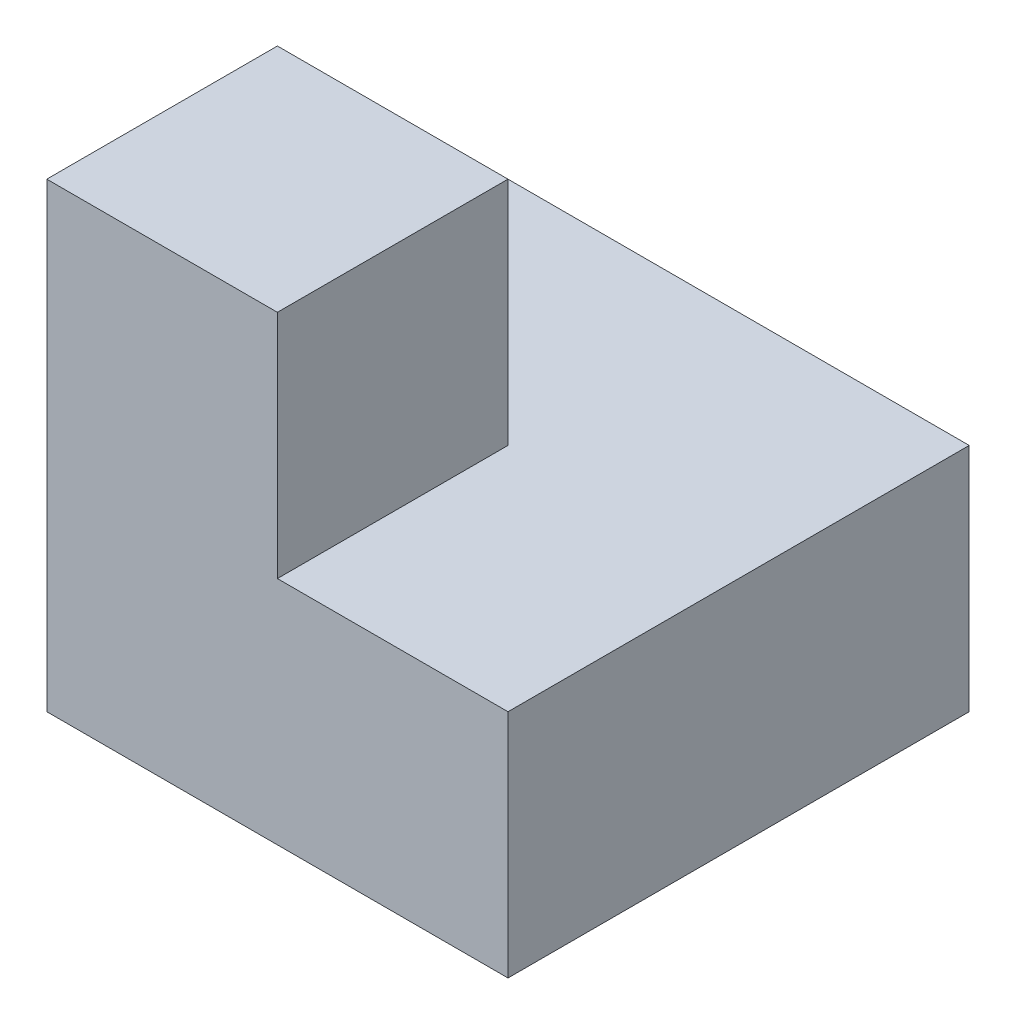
ISO-10303-21;
HEADER;
FILE_DESCRIPTION(('STEP AP214'),'2;1');
FILE_NAME('part.step','',(''),(''),'','','');
FILE_SCHEMA(('AUTOMOTIVE_DESIGN { 1 0 10303 214 1 1 1 1 }'));
ENDSEC;
DATA;
#1=APPLICATION_CONTEXT('core data for automotive mechanical design processes');
#2=APPLICATION_PROTOCOL_DEFINITION('international standard','automotive_design',2000,#1);
#3=PRODUCT_CONTEXT('',#1,'mechanical');
#4=PRODUCT('Part','Part','',(#3));
#5=PRODUCT_RELATED_PRODUCT_CATEGORY('part','',(#4));
#6=PRODUCT_DEFINITION_FORMATION('','',#4);
#7=PRODUCT_DEFINITION_CONTEXT('part definition',#1,'design');
#8=PRODUCT_DEFINITION('design','',#6,#7);
#9=PRODUCT_DEFINITION_SHAPE('','',#8);
#10=(LENGTH_UNIT() NAMED_UNIT(*) SI_UNIT(.MILLI.,.METRE.));
#11=(NAMED_UNIT(*) PLANE_ANGLE_UNIT() SI_UNIT($,.RADIAN.));
#12=(NAMED_UNIT(*) SI_UNIT($,.STERADIAN.) SOLID_ANGLE_UNIT());
#13=UNCERTAINTY_MEASURE_WITH_UNIT(LENGTH_MEASURE(1.E-05),#10,'distance_accuracy_value','');
#14=(GEOMETRIC_REPRESENTATION_CONTEXT(3) GLOBAL_UNCERTAINTY_ASSIGNED_CONTEXT((#13)) GLOBAL_UNIT_ASSIGNED_CONTEXT((#10,
#11,#12)) REPRESENTATION_CONTEXT('',''));
#15=CARTESIAN_POINT('',(0.,0.,0.));
#16=DIRECTION('',(0.,0.,1.));
#17=DIRECTION('',(1.,0.,0.));
#18=AXIS2_PLACEMENT_3D('',#15,#16,#17);
#19=CARTESIAN_POINT('',(4.,4.,0.));
#20=DIRECTION('',(-1.,0.,0.));
#21=DIRECTION('',(0.,0.,1.));
#22=AXIS2_PLACEMENT_3D('',#19,#20,#21);
#23=PLANE('',#22);
#24=DIRECTION('',(0.,0.,-1.));
#25=VECTOR('',#24,1.);
#26=CARTESIAN_POINT('',(4.,2.,0.));
#27=LINE('',#26,#25);
#28=CARTESIAN_POINT('',(4.,2.,0.));
#29=VERTEX_POINT('',#28);
#30=CARTESIAN_POINT('',(4.,2.,-4.));
#31=VERTEX_POINT('',#30);
#32=EDGE_CURVE('E170',#29,#31,#27,.T.);
#33=ORIENTED_EDGE('',*,*,#32,.F.);
#34=DIRECTION('',(0.,-1.,0.));
#35=VECTOR('',#34,1.);
#36=CARTESIAN_POINT('',(4.,4.,0.));
#37=LINE('',#36,#35);
#38=CARTESIAN_POINT('',(4.,0.,0.));
#39=VERTEX_POINT('',#38);
#40=EDGE_CURVE('E43',#29,#39,#37,.T.);
#41=ORIENTED_EDGE('',*,*,#40,.T.);
#42=DIRECTION('',(0.,0.,-1.));
#43=VECTOR('',#42,1.);
#44=CARTESIAN_POINT('',(4.,0.,0.));
#45=LINE('',#44,#43);
#46=CARTESIAN_POINT('',(4.,0.,-4.));
#47=VERTEX_POINT('',#46);
#48=EDGE_CURVE('E93',#39,#47,#45,.T.);
#49=ORIENTED_EDGE('',*,*,#48,.T.);
#50=DIRECTION('',(0.,-1.,0.));
#51=VECTOR('',#50,1.);
#52=CARTESIAN_POINT('',(4.,4.,-4.));
#53=LINE('',#52,#51);
#54=EDGE_CURVE('E78',#31,#47,#53,.T.);
#55=ORIENTED_EDGE('',*,*,#54,.F.);
#56=EDGE_LOOP('',(#33,#41,#49,#55));
#57=FACE_BOUND('',#56,.T.);
#58=ADVANCED_FACE('F35',(#57),#23,.F.);
#59=CARTESIAN_POINT('',(0.,4.,-4.));
#60=DIRECTION('',(0.,0.,1.));
#61=DIRECTION('',(1.,0.,0.));
#62=AXIS2_PLACEMENT_3D('',#59,#60,#61);
#63=PLANE('',#62);
#64=DIRECTION('',(-1.,0.,0.));
#65=VECTOR('',#64,1.);
#66=CARTESIAN_POINT('',(0.,2.,-4.));
#67=LINE('',#66,#65);
#68=CARTESIAN_POINT('',(0.,2.,-4.));
#69=VERTEX_POINT('',#68);
#70=EDGE_CURVE('E87',#31,#69,#67,.T.);
#71=ORIENTED_EDGE('',*,*,#70,.F.);
#72=ORIENTED_EDGE('',*,*,#54,.T.);
#73=DIRECTION('',(-1.,0.,0.));
#74=VECTOR('',#73,1.);
#75=CARTESIAN_POINT('',(0.,0.,-4.));
#76=LINE('',#75,#74);
#77=CARTESIAN_POINT('',(0.,0.,-4.));
#78=VERTEX_POINT('',#77);
#79=EDGE_CURVE('E83',#47,#78,#76,.T.);
#80=ORIENTED_EDGE('',*,*,#79,.T.);
#81=DIRECTION('',(0.,-1.,0.));
#82=VECTOR('',#81,1.);
#83=CARTESIAN_POINT('',(0.,4.,-4.));
#84=LINE('',#83,#82);
#85=EDGE_CURVE('E90',#69,#78,#84,.T.);
#86=ORIENTED_EDGE('',*,*,#85,.F.);
#87=EDGE_LOOP('',(#71,#72,#80,#86));
#88=FACE_BOUND('',#87,.T.);
#89=ADVANCED_FACE('F80',(#88),#63,.F.);
#90=CARTESIAN_POINT('',(0.,4.,0.));
#91=DIRECTION('',(1.,0.,0.));
#92=DIRECTION('',(0.,0.,-1.));
#93=AXIS2_PLACEMENT_3D('',#90,#91,#92);
#94=PLANE('',#93);
#95=DIRECTION('',(0.,0.,1.));
#96=VECTOR('',#95,1.);
#97=CARTESIAN_POINT('',(0.,4.,0.));
#98=LINE('',#97,#96);
#99=CARTESIAN_POINT('',(0.,4.,-2.));
#100=VERTEX_POINT('',#99);
#101=CARTESIAN_POINT('',(0.,4.,0.));
#102=VERTEX_POINT('',#101);
#103=EDGE_CURVE('E58',#100,#102,#98,.T.);
#104=ORIENTED_EDGE('',*,*,#103,.F.);
#105=DIRECTION('',(0.,1.,0.));
#106=VECTOR('',#105,1.);
#107=CARTESIAN_POINT('',(0.,2.,-2.));
#108=LINE('',#107,#106);
#109=CARTESIAN_POINT('',(0.,2.,-2.));
#110=VERTEX_POINT('',#109);
#111=EDGE_CURVE('E114',#110,#100,#108,.T.);
#112=ORIENTED_EDGE('',*,*,#111,.F.);
#113=DIRECTION('',(0.,0.,1.));
#114=VECTOR('',#113,1.);
#115=CARTESIAN_POINT('',(0.,2.,0.));
#116=LINE('',#115,#114);
#117=EDGE_CURVE('E160',#69,#110,#116,.T.);
#118=ORIENTED_EDGE('',*,*,#117,.F.);
#119=ORIENTED_EDGE('',*,*,#85,.T.);
#120=DIRECTION('',(0.,0.,1.));
#121=VECTOR('',#120,1.);
#122=CARTESIAN_POINT('',(0.,0.,0.));
#123=LINE('',#122,#121);
#124=CARTESIAN_POINT('',(0.,0.,0.));
#125=VERTEX_POINT('',#124);
#126=EDGE_CURVE('E101',#78,#125,#123,.T.);
#127=ORIENTED_EDGE('',*,*,#126,.T.);
#128=DIRECTION('',(0.,-1.,0.));
#129=VECTOR('',#128,1.);
#130=CARTESIAN_POINT('',(0.,4.,0.));
#131=LINE('',#130,#129);
#132=EDGE_CURVE('E11',#102,#125,#131,.T.);
#133=ORIENTED_EDGE('',*,*,#132,.F.);
#134=EDGE_LOOP('',(#104,#112,#118,#119,#127,#133));
#135=FACE_BOUND('',#134,.T.);
#136=ADVANCED_FACE('F37',(#135),#94,.F.);
#137=CARTESIAN_POINT('',(0.,4.,0.));
#138=DIRECTION('',(0.,0.,-1.));
#139=DIRECTION('',(-1.,0.,0.));
#140=AXIS2_PLACEMENT_3D('',#137,#138,#139);
#141=PLANE('',#140);
#142=DIRECTION('',(1.,0.,0.));
#143=VECTOR('',#142,1.);
#144=CARTESIAN_POINT('',(0.,2.,0.));
#145=LINE('',#144,#143);
#146=CARTESIAN_POINT('',(2.,2.,0.));
#147=VERTEX_POINT('',#146);
#148=EDGE_CURVE('E164',#147,#29,#145,.T.);
#149=ORIENTED_EDGE('',*,*,#148,.F.);
#150=DIRECTION('',(0.,1.,0.));
#151=VECTOR('',#150,1.);
#152=CARTESIAN_POINT('',(2.,2.,0.));
#153=LINE('',#152,#151);
#154=CARTESIAN_POINT('',(2.,4.,0.));
#155=VERTEX_POINT('',#154);
#156=EDGE_CURVE('E178',#147,#155,#153,.T.);
#157=ORIENTED_EDGE('',*,*,#156,.T.);
#158=DIRECTION('',(1.,0.,0.));
#159=VECTOR('',#158,1.);
#160=CARTESIAN_POINT('',(0.,4.,0.));
#161=LINE('',#160,#159);
#162=EDGE_CURVE('E103',#102,#155,#161,.T.);
#163=ORIENTED_EDGE('',*,*,#162,.F.);
#164=ORIENTED_EDGE('',*,*,#132,.T.);
#165=DIRECTION('',(1.,0.,0.));
#166=VECTOR('',#165,1.);
#167=CARTESIAN_POINT('',(0.,0.,0.));
#168=LINE('',#167,#166);
#169=EDGE_CURVE('E97',#125,#39,#168,.T.);
#170=ORIENTED_EDGE('',*,*,#169,.T.);
#171=ORIENTED_EDGE('',*,*,#40,.F.);
#172=EDGE_LOOP('',(#149,#157,#163,#164,#170,#171));
#173=FACE_BOUND('',#172,.T.);
#174=ADVANCED_FACE('F117',(#173),#141,.F.);
#175=CARTESIAN_POINT('',(0.,4.,0.));
#176=DIRECTION('',(0.,-1.,0.));
#177=DIRECTION('',(0.,0.,-1.));
#178=AXIS2_PLACEMENT_3D('',#175,#176,#177);
#179=PLANE('',#178);
#180=DIRECTION('',(0.,0.,1.));
#181=VECTOR('',#180,1.);
#182=CARTESIAN_POINT('',(2.,4.,0.));
#183=LINE('',#182,#181);
#184=CARTESIAN_POINT('',(2.,4.,-2.));
#185=VERTEX_POINT('',#184);
#186=EDGE_CURVE('E162',#185,#155,#183,.T.);
#187=ORIENTED_EDGE('',*,*,#186,.F.);
#188=DIRECTION('',(1.,0.,0.));
#189=VECTOR('',#188,1.);
#190=CARTESIAN_POINT('',(0.,4.,-2.));
#191=LINE('',#190,#189);
#192=EDGE_CURVE('E50',#100,#185,#191,.T.);
#193=ORIENTED_EDGE('',*,*,#192,.F.);
#194=ORIENTED_EDGE('',*,*,#103,.T.);
#195=ORIENTED_EDGE('',*,*,#162,.T.);
#196=EDGE_LOOP('',(#187,#193,#194,#195));
#197=FACE_BOUND('',#196,.T.);
#198=ADVANCED_FACE('F127',(#197),#179,.F.);
#199=CARTESIAN_POINT('',(0.,0.,0.));
#200=DIRECTION('',(0.,-1.,0.));
#201=DIRECTION('',(0.,0.,-1.));
#202=AXIS2_PLACEMENT_3D('',#199,#200,#201);
#203=PLANE('',#202);
#204=ORIENTED_EDGE('',*,*,#126,.F.);
#205=ORIENTED_EDGE('',*,*,#79,.F.);
#206=ORIENTED_EDGE('',*,*,#48,.F.);
#207=ORIENTED_EDGE('',*,*,#169,.F.);
#208=EDGE_LOOP('',(#204,#205,#206,#207));
#209=FACE_BOUND('',#208,.T.);
#210=ADVANCED_FACE('F99',(#209),#203,.T.);
#211=CARTESIAN_POINT('',(0.,2.,-2.));
#212=DIRECTION('',(0.,0.,1.));
#213=DIRECTION('',(1.,0.,0.));
#214=AXIS2_PLACEMENT_3D('',#211,#212,#213);
#215=PLANE('',#214);
#216=ORIENTED_EDGE('',*,*,#192,.T.);
#217=DIRECTION('',(0.,1.,0.));
#218=VECTOR('',#217,1.);
#219=CARTESIAN_POINT('',(2.,2.,-2.));
#220=LINE('',#219,#218);
#221=CARTESIAN_POINT('',(2.,2.,-2.));
#222=VERTEX_POINT('',#221);
#223=EDGE_CURVE('E175',#222,#185,#220,.T.);
#224=ORIENTED_EDGE('',*,*,#223,.F.);
#225=DIRECTION('',(1.,0.,0.));
#226=VECTOR('',#225,1.);
#227=CARTESIAN_POINT('',(0.,2.,-2.));
#228=LINE('',#227,#226);
#229=EDGE_CURVE('E155',#110,#222,#228,.T.);
#230=ORIENTED_EDGE('',*,*,#229,.F.);
#231=ORIENTED_EDGE('',*,*,#111,.T.);
#232=EDGE_LOOP('',(#216,#224,#230,#231));
#233=FACE_BOUND('',#232,.T.);
#234=ADVANCED_FACE('F136',(#233),#215,.F.);
#235=CARTESIAN_POINT('',(2.,2.,0.));
#236=DIRECTION('',(-1.,0.,0.));
#237=DIRECTION('',(0.,0.,1.));
#238=AXIS2_PLACEMENT_3D('',#235,#236,#237);
#239=PLANE('',#238);
#240=ORIENTED_EDGE('',*,*,#186,.T.);
#241=ORIENTED_EDGE('',*,*,#156,.F.);
#242=DIRECTION('',(0.,0.,1.));
#243=VECTOR('',#242,1.);
#244=CARTESIAN_POINT('',(2.,2.,0.));
#245=LINE('',#244,#243);
#246=EDGE_CURVE('E159',#222,#147,#245,.T.);
#247=ORIENTED_EDGE('',*,*,#246,.F.);
#248=ORIENTED_EDGE('',*,*,#223,.T.);
#249=EDGE_LOOP('',(#240,#241,#247,#248));
#250=FACE_BOUND('',#249,.T.);
#251=ADVANCED_FACE('F141',(#250),#239,.F.);
#252=CARTESIAN_POINT('',(0.,2.,0.));
#253=DIRECTION('',(0.,1.,0.));
#254=DIRECTION('',(0.,0.,1.));
#255=AXIS2_PLACEMENT_3D('',#252,#253,#254);
#256=PLANE('',#255);
#257=ORIENTED_EDGE('',*,*,#229,.T.);
#258=ORIENTED_EDGE('',*,*,#246,.T.);
#259=ORIENTED_EDGE('',*,*,#148,.T.);
#260=ORIENTED_EDGE('',*,*,#32,.T.);
#261=ORIENTED_EDGE('',*,*,#70,.T.);
#262=ORIENTED_EDGE('',*,*,#117,.T.);
#263=EDGE_LOOP('',(#257,#258,#259,#260,#261,#262));
#264=FACE_BOUND('',#263,.T.);
#265=ADVANCED_FACE('F144',(#264),#256,.T.);
#266=CLOSED_SHELL('',(#58,#89,#136,#174,#198,#210,#234,#251,#265));
#267=MANIFOLD_SOLID_BREP('B2',#266);
#268=ADVANCED_BREP_SHAPE_REPRESENTATION('',(#18,#267),#14);
#269=SHAPE_DEFINITION_REPRESENTATION(#9,#268);
ENDSEC;
END-ISO-10303-21;
